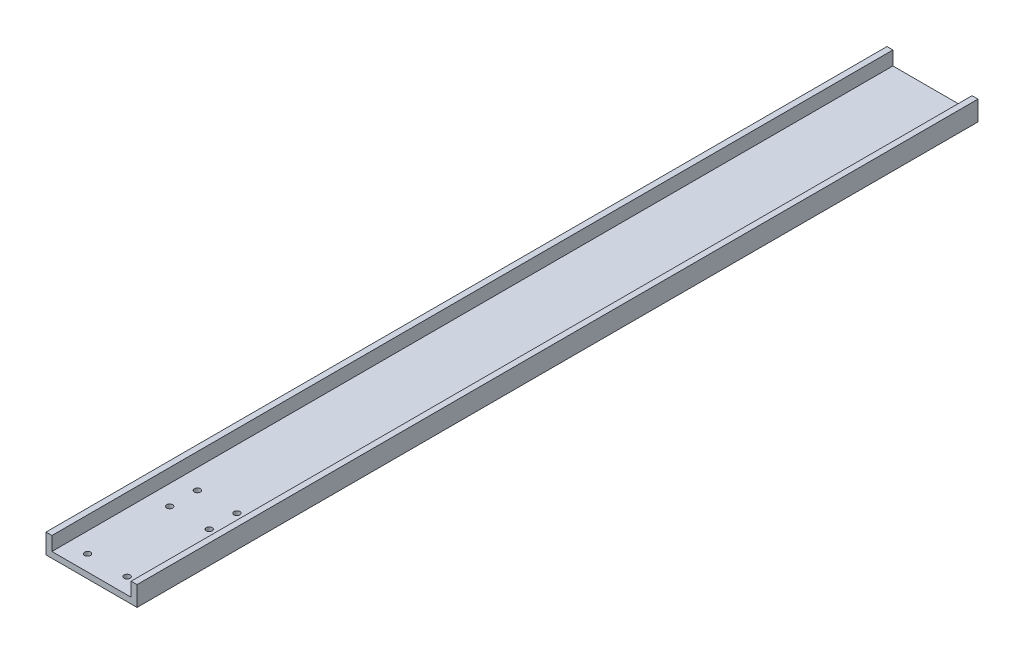
ISO-10303-21;
HEADER;
FILE_DESCRIPTION(('STEP AP214'),'2;1');
FILE_NAME('part.step','',(''),(''),'','','');
FILE_SCHEMA(('AUTOMOTIVE_DESIGN { 1 0 10303 214 1 1 1 1 }'));
ENDSEC;
DATA;
#1=APPLICATION_CONTEXT('core data for automotive mechanical design processes');
#2=APPLICATION_PROTOCOL_DEFINITION('international standard','automotive_design',2000,#1);
#3=PRODUCT_CONTEXT('',#1,'mechanical');
#4=PRODUCT('Part','Part','',(#3));
#5=PRODUCT_RELATED_PRODUCT_CATEGORY('part','',(#4));
#6=PRODUCT_DEFINITION_FORMATION('','',#4);
#7=PRODUCT_DEFINITION_CONTEXT('part definition',#1,'design');
#8=PRODUCT_DEFINITION('design','',#6,#7);
#9=PRODUCT_DEFINITION_SHAPE('','',#8);
#10=(LENGTH_UNIT() NAMED_UNIT(*) SI_UNIT(.MILLI.,.METRE.));
#11=(NAMED_UNIT(*) PLANE_ANGLE_UNIT() SI_UNIT($,.RADIAN.));
#12=(NAMED_UNIT(*) SI_UNIT($,.STERADIAN.) SOLID_ANGLE_UNIT());
#13=UNCERTAINTY_MEASURE_WITH_UNIT(LENGTH_MEASURE(1.E-05),#10,'distance_accuracy_value','');
#14=(GEOMETRIC_REPRESENTATION_CONTEXT(3) GLOBAL_UNCERTAINTY_ASSIGNED_CONTEXT((#13)) GLOBAL_UNIT_ASSIGNED_CONTEXT((#10,
#11,#12)) REPRESENTATION_CONTEXT('',''));
#15=CARTESIAN_POINT('',(0.,0.,0.));
#16=DIRECTION('',(0.,0.,1.));
#17=DIRECTION('',(1.,0.,0.));
#18=AXIS2_PLACEMENT_3D('',#15,#16,#17);
#19=CARTESIAN_POINT('',(-3.,-3.,425.));
#20=DIRECTION('',(0.,1.,0.));
#21=DIRECTION('',(-1.,0.,0.));
#22=AXIS2_PLACEMENT_3D('',#19,#20,#21);
#23=PLANE('',#22);
#24=CARTESIAN_POINT('',(30.,-3.,417.));
#25=DIRECTION('',(0.,-1.,0.));
#26=DIRECTION('',(0.,0.,-1.));
#27=AXIS2_PLACEMENT_3D('',#24,#25,#26);
#28=CIRCLE('',#27,1.49999999999999);
#29=CARTESIAN_POINT('',(30.,-3.,415.5));
#30=VERTEX_POINT('',#29);
#31=EDGE_CURVE('E252',#30,#30,#28,.T.);
#32=ORIENTED_EDGE('',*,*,#31,.F.);
#33=EDGE_LOOP('',(#32));
#34=FACE_BOUND('',#33,.T.);
#35=DIRECTION('',(1.,0.,0.));
#36=VECTOR('',#35,1.);
#37=CARTESIAN_POINT('',(-3.,-3.,0.));
#38=LINE('',#37,#36);
#39=CARTESIAN_POINT('',(-3.,-3.,0.));
#40=VERTEX_POINT('',#39);
#41=CARTESIAN_POINT('',(43.,-3.,0.));
#42=VERTEX_POINT('',#41);
#43=EDGE_CURVE('E122',#40,#42,#38,.T.);
#44=ORIENTED_EDGE('',*,*,#43,.T.);
#45=DIRECTION('',(0.,0.,-1.));
#46=VECTOR('',#45,1.);
#47=CARTESIAN_POINT('',(43.,-3.,425.));
#48=LINE('',#47,#46);
#49=CARTESIAN_POINT('',(43.,-3.,425.));
#50=VERTEX_POINT('',#49);
#51=EDGE_CURVE('E119',#50,#42,#48,.T.);
#52=ORIENTED_EDGE('',*,*,#51,.F.);
#53=DIRECTION('',(1.,0.,0.));
#54=VECTOR('',#53,1.);
#55=CARTESIAN_POINT('',(-3.,-3.,425.));
#56=LINE('',#55,#54);
#57=CARTESIAN_POINT('',(-3.,-3.,425.));
#58=VERTEX_POINT('',#57);
#59=EDGE_CURVE('E108',#58,#50,#56,.T.);
#60=ORIENTED_EDGE('',*,*,#59,.F.);
#61=DIRECTION('',(0.,0.,-1.));
#62=VECTOR('',#61,1.);
#63=CARTESIAN_POINT('',(-3.,-3.,425.));
#64=LINE('',#63,#62);
#65=EDGE_CURVE('E123',#58,#40,#64,.T.);
#66=ORIENTED_EDGE('',*,*,#65,.T.);
#67=EDGE_LOOP('',(#44,#52,#60,#66));
#68=FACE_BOUND('',#67,.T.);
#69=CARTESIAN_POINT('',(10.,-3.,361.5));
#70=DIRECTION('',(0.,1.,0.));
#71=DIRECTION('',(-1.,0.,0.));
#72=AXIS2_PLACEMENT_3D('',#69,#70,#71);
#73=CIRCLE('',#72,1.49999999999999);
#74=CARTESIAN_POINT('',(8.50000000000001,-3.,361.5));
#75=VERTEX_POINT('',#74);
#76=EDGE_CURVE('E136',#75,#75,#73,.T.);
#77=ORIENTED_EDGE('',*,*,#76,.T.);
#78=EDGE_LOOP('',(#77));
#79=FACE_BOUND('',#78,.T.);
#80=CARTESIAN_POINT('',(30.,-3.,361.5));
#81=DIRECTION('',(0.,1.,0.));
#82=DIRECTION('',(-1.,0.,0.));
#83=AXIS2_PLACEMENT_3D('',#80,#81,#82);
#84=CIRCLE('',#83,1.49999999999999);
#85=CARTESIAN_POINT('',(28.5,-3.,361.5));
#86=VERTEX_POINT('',#85);
#87=EDGE_CURVE('E158',#86,#86,#84,.T.);
#88=ORIENTED_EDGE('',*,*,#87,.T.);
#89=EDGE_LOOP('',(#88));
#90=FACE_BOUND('',#89,.T.);
#91=CARTESIAN_POINT('',(30.,-3.,375.5));
#92=DIRECTION('',(0.,1.,0.));
#93=DIRECTION('',(-1.,0.,0.));
#94=AXIS2_PLACEMENT_3D('',#91,#92,#93);
#95=CIRCLE('',#94,1.49999999999999);
#96=CARTESIAN_POINT('',(28.5,-3.,375.5));
#97=VERTEX_POINT('',#96);
#98=EDGE_CURVE('E167',#97,#97,#95,.T.);
#99=ORIENTED_EDGE('',*,*,#98,.T.);
#100=EDGE_LOOP('',(#99));
#101=FACE_BOUND('',#100,.T.);
#102=CARTESIAN_POINT('',(10.,-3.,375.5));
#103=DIRECTION('',(0.,1.,0.));
#104=DIRECTION('',(-1.,0.,0.));
#105=AXIS2_PLACEMENT_3D('',#102,#103,#104);
#106=CIRCLE('',#105,1.49999999999999);
#107=CARTESIAN_POINT('',(8.50000000000001,-3.,375.5));
#108=VERTEX_POINT('',#107);
#109=EDGE_CURVE('E37',#108,#108,#106,.T.);
#110=ORIENTED_EDGE('',*,*,#109,.T.);
#111=EDGE_LOOP('',(#110));
#112=FACE_BOUND('',#111,.T.);
#113=CARTESIAN_POINT('',(10.,-3.,417.));
#114=DIRECTION('',(0.,-1.,0.));
#115=DIRECTION('',(0.,0.,-1.));
#116=AXIS2_PLACEMENT_3D('',#113,#114,#115);
#117=CIRCLE('',#116,1.49999999999999);
#118=CARTESIAN_POINT('',(10.,-3.,415.5));
#119=VERTEX_POINT('',#118);
#120=EDGE_CURVE('E246',#119,#119,#117,.T.);
#121=ORIENTED_EDGE('',*,*,#120,.F.);
#122=EDGE_LOOP('',(#121));
#123=FACE_BOUND('',#122,.T.);
#124=ADVANCED_FACE('F33',(#34,#68,#79,#90,#101,#112,#123),#23,.F.);
#125=CARTESIAN_POINT('',(40.,0.,425.));
#126=DIRECTION('',(0.,-1.,0.));
#127=DIRECTION('',(0.,0.,-1.));
#128=AXIS2_PLACEMENT_3D('',#125,#126,#127);
#129=PLANE('',#128);
#130=CARTESIAN_POINT('',(30.,0.,417.));
#131=DIRECTION('',(0.,-1.,0.));
#132=DIRECTION('',(0.,0.,-1.));
#133=AXIS2_PLACEMENT_3D('',#130,#131,#132);
#134=CIRCLE('',#133,1.49999999999999);
#135=CARTESIAN_POINT('',(30.,0.,415.5));
#136=VERTEX_POINT('',#135);
#137=EDGE_CURVE('E249',#136,#136,#134,.T.);
#138=ORIENTED_EDGE('',*,*,#137,.T.);
#139=EDGE_LOOP('',(#138));
#140=FACE_BOUND('',#139,.T.);
#141=CARTESIAN_POINT('',(10.,0.,417.));
#142=DIRECTION('',(0.,-1.,0.));
#143=DIRECTION('',(0.,0.,-1.));
#144=AXIS2_PLACEMENT_3D('',#141,#142,#143);
#145=CIRCLE('',#144,1.49999999999999);
#146=CARTESIAN_POINT('',(10.,0.,415.5));
#147=VERTEX_POINT('',#146);
#148=EDGE_CURVE('E243',#147,#147,#145,.T.);
#149=ORIENTED_EDGE('',*,*,#148,.T.);
#150=EDGE_LOOP('',(#149));
#151=FACE_BOUND('',#150,.T.);
#152=CARTESIAN_POINT('',(10.,0.,375.5));
#153=DIRECTION('',(0.,1.,0.));
#154=DIRECTION('',(0.,0.,1.));
#155=AXIS2_PLACEMENT_3D('',#152,#153,#154);
#156=CIRCLE('',#155,1.49999999999999);
#157=CARTESIAN_POINT('',(10.,0.,377.));
#158=VERTEX_POINT('',#157);
#159=EDGE_CURVE('E239',#158,#158,#156,.T.);
#160=ORIENTED_EDGE('',*,*,#159,.F.);
#161=EDGE_LOOP('',(#160));
#162=FACE_BOUND('',#161,.T.);
#163=DIRECTION('',(-1.,0.,0.));
#164=VECTOR('',#163,1.);
#165=CARTESIAN_POINT('',(40.,0.,0.));
#166=LINE('',#165,#164);
#167=CARTESIAN_POINT('',(40.,0.,0.));
#168=VERTEX_POINT('',#167);
#169=CARTESIAN_POINT('',(0.,0.,0.));
#170=VERTEX_POINT('',#169);
#171=EDGE_CURVE('E135',#168,#170,#166,.T.);
#172=ORIENTED_EDGE('',*,*,#171,.T.);
#173=DIRECTION('',(0.,0.,-1.));
#174=VECTOR('',#173,1.);
#175=CARTESIAN_POINT('',(0.,0.,425.));
#176=LINE('',#175,#174);
#177=CARTESIAN_POINT('',(0.,0.,425.));
#178=VERTEX_POINT('',#177);
#179=EDGE_CURVE('E43',#178,#170,#176,.T.);
#180=ORIENTED_EDGE('',*,*,#179,.F.);
#181=DIRECTION('',(-1.,0.,0.));
#182=VECTOR('',#181,1.);
#183=CARTESIAN_POINT('',(40.,0.,425.));
#184=LINE('',#183,#182);
#185=CARTESIAN_POINT('',(40.,0.,425.));
#186=VERTEX_POINT('',#185);
#187=EDGE_CURVE('E95',#186,#178,#184,.T.);
#188=ORIENTED_EDGE('',*,*,#187,.F.);
#189=DIRECTION('',(0.,0.,-1.));
#190=VECTOR('',#189,1.);
#191=CARTESIAN_POINT('',(40.,0.,425.));
#192=LINE('',#191,#190);
#193=EDGE_CURVE('E11',#186,#168,#192,.T.);
#194=ORIENTED_EDGE('',*,*,#193,.T.);
#195=EDGE_LOOP('',(#172,#180,#188,#194));
#196=FACE_BOUND('',#195,.T.);
#197=CARTESIAN_POINT('',(10.,0.,361.5));
#198=DIRECTION('',(0.,1.,0.));
#199=DIRECTION('',(0.,0.,1.));
#200=AXIS2_PLACEMENT_3D('',#197,#198,#199);
#201=CIRCLE('',#200,1.49999999999999);
#202=CARTESIAN_POINT('',(10.,0.,363.));
#203=VERTEX_POINT('',#202);
#204=EDGE_CURVE('E160',#203,#203,#201,.T.);
#205=ORIENTED_EDGE('',*,*,#204,.F.);
#206=EDGE_LOOP('',(#205));
#207=FACE_BOUND('',#206,.T.);
#208=CARTESIAN_POINT('',(30.,0.,361.5));
#209=DIRECTION('',(0.,1.,0.));
#210=DIRECTION('',(0.,0.,1.));
#211=AXIS2_PLACEMENT_3D('',#208,#209,#210);
#212=CIRCLE('',#211,1.49999999999999);
#213=CARTESIAN_POINT('',(30.,0.,363.));
#214=VERTEX_POINT('',#213);
#215=EDGE_CURVE('E161',#214,#214,#212,.T.);
#216=ORIENTED_EDGE('',*,*,#215,.F.);
#217=EDGE_LOOP('',(#216));
#218=FACE_BOUND('',#217,.T.);
#219=CARTESIAN_POINT('',(30.,0.,375.5));
#220=DIRECTION('',(0.,1.,0.));
#221=DIRECTION('',(0.,0.,1.));
#222=AXIS2_PLACEMENT_3D('',#219,#220,#221);
#223=CIRCLE('',#222,1.49999999999999);
#224=CARTESIAN_POINT('',(30.,0.,377.));
#225=VERTEX_POINT('',#224);
#226=EDGE_CURVE('E172',#225,#225,#223,.T.);
#227=ORIENTED_EDGE('',*,*,#226,.F.);
#228=EDGE_LOOP('',(#227));
#229=FACE_BOUND('',#228,.T.);
#230=ADVANCED_FACE('F211',(#140,#151,#162,#196,#207,#218,#229),#129,.F.);
#231=CARTESIAN_POINT('',(40.,6.99999999999999,425.));
#232=DIRECTION('',(1.,0.,0.));
#233=DIRECTION('',(0.,0.,-1.));
#234=AXIS2_PLACEMENT_3D('',#231,#232,#233);
#235=PLANE('',#234);
#236=DIRECTION('',(0.,-1.,0.));
#237=VECTOR('',#236,1.);
#238=CARTESIAN_POINT('',(40.,6.99999999999999,0.));
#239=LINE('',#238,#237);
#240=CARTESIAN_POINT('',(40.,6.99999999999999,0.));
#241=VERTEX_POINT('',#240);
#242=EDGE_CURVE('E132',#241,#168,#239,.T.);
#243=ORIENTED_EDGE('',*,*,#242,.T.);
#244=ORIENTED_EDGE('',*,*,#193,.F.);
#245=DIRECTION('',(0.,-1.,0.));
#246=VECTOR('',#245,1.);
#247=CARTESIAN_POINT('',(40.,6.99999999999999,425.));
#248=LINE('',#247,#246);
#249=CARTESIAN_POINT('',(40.,6.99999999999999,425.));
#250=VERTEX_POINT('',#249);
#251=EDGE_CURVE('E147',#250,#186,#248,.T.);
#252=ORIENTED_EDGE('',*,*,#251,.F.);
#253=DIRECTION('',(0.,0.,-1.));
#254=VECTOR('',#253,1.);
#255=CARTESIAN_POINT('',(40.,6.99999999999999,425.));
#256=LINE('',#255,#254);
#257=EDGE_CURVE('E128',#250,#241,#256,.T.);
#258=ORIENTED_EDGE('',*,*,#257,.T.);
#259=EDGE_LOOP('',(#243,#244,#252,#258));
#260=FACE_BOUND('',#259,.T.);
#261=ADVANCED_FACE('F35',(#260),#235,.F.);
#262=CARTESIAN_POINT('',(0.,0.,425.));
#263=DIRECTION('',(-1.,0.,0.));
#264=DIRECTION('',(0.,0.,1.));
#265=AXIS2_PLACEMENT_3D('',#262,#263,#264);
#266=PLANE('',#265);
#267=DIRECTION('',(0.,1.,0.));
#268=VECTOR('',#267,1.);
#269=CARTESIAN_POINT('',(0.,0.,0.));
#270=LINE('',#269,#268);
#271=CARTESIAN_POINT('',(0.,6.99999999999999,0.));
#272=VERTEX_POINT('',#271);
#273=EDGE_CURVE('E138',#170,#272,#270,.T.);
#274=ORIENTED_EDGE('',*,*,#273,.T.);
#275=DIRECTION('',(0.,0.,-1.));
#276=VECTOR('',#275,1.);
#277=CARTESIAN_POINT('',(0.,6.99999999999999,425.));
#278=LINE('',#277,#276);
#279=CARTESIAN_POINT('',(0.,6.99999999999999,425.));
#280=VERTEX_POINT('',#279);
#281=EDGE_CURVE('E154',#280,#272,#278,.T.);
#282=ORIENTED_EDGE('',*,*,#281,.F.);
#283=DIRECTION('',(0.,1.,0.));
#284=VECTOR('',#283,1.);
#285=CARTESIAN_POINT('',(0.,0.,425.));
#286=LINE('',#285,#284);
#287=EDGE_CURVE('E180',#178,#280,#286,.T.);
#288=ORIENTED_EDGE('',*,*,#287,.F.);
#289=ORIENTED_EDGE('',*,*,#179,.T.);
#290=EDGE_LOOP('',(#274,#282,#288,#289));
#291=FACE_BOUND('',#290,.T.);
#292=ADVANCED_FACE('F225',(#291),#266,.F.);
#293=CARTESIAN_POINT('',(0.,6.99999999999999,425.));
#294=DIRECTION('',(0.,-1.,0.));
#295=DIRECTION('',(0.,0.,-1.));
#296=AXIS2_PLACEMENT_3D('',#293,#294,#295);
#297=PLANE('',#296);
#298=DIRECTION('',(-1.,0.,0.));
#299=VECTOR('',#298,1.);
#300=CARTESIAN_POINT('',(0.,6.99999999999999,0.));
#301=LINE('',#300,#299);
#302=CARTESIAN_POINT('',(-3.,6.99999999999999,0.));
#303=VERTEX_POINT('',#302);
#304=EDGE_CURVE('E140',#272,#303,#301,.T.);
#305=ORIENTED_EDGE('',*,*,#304,.T.);
#306=DIRECTION('',(0.,0.,-1.));
#307=VECTOR('',#306,1.);
#308=CARTESIAN_POINT('',(-3.,6.99999999999999,425.));
#309=LINE('',#308,#307);
#310=CARTESIAN_POINT('',(-3.,6.99999999999999,425.));
#311=VERTEX_POINT('',#310);
#312=EDGE_CURVE('E151',#311,#303,#309,.T.);
#313=ORIENTED_EDGE('',*,*,#312,.F.);
#314=DIRECTION('',(-1.,0.,0.));
#315=VECTOR('',#314,1.);
#316=CARTESIAN_POINT('',(0.,6.99999999999999,425.));
#317=LINE('',#316,#315);
#318=EDGE_CURVE('E182',#280,#311,#317,.T.);
#319=ORIENTED_EDGE('',*,*,#318,.F.);
#320=ORIENTED_EDGE('',*,*,#281,.T.);
#321=EDGE_LOOP('',(#305,#313,#319,#320));
#322=FACE_BOUND('',#321,.T.);
#323=ADVANCED_FACE('F188',(#322),#297,.F.);
#324=CARTESIAN_POINT('',(-3.,6.99999999999999,425.));
#325=DIRECTION('',(1.,0.,0.));
#326=DIRECTION('',(0.,1.,0.));
#327=AXIS2_PLACEMENT_3D('',#324,#325,#326);
#328=PLANE('',#327);
#329=DIRECTION('',(0.,-1.,0.));
#330=VECTOR('',#329,1.);
#331=CARTESIAN_POINT('',(-3.,6.99999999999999,0.));
#332=LINE('',#331,#330);
#333=EDGE_CURVE('E142',#303,#40,#332,.T.);
#334=ORIENTED_EDGE('',*,*,#333,.T.);
#335=ORIENTED_EDGE('',*,*,#65,.F.);
#336=DIRECTION('',(0.,-1.,0.));
#337=VECTOR('',#336,1.);
#338=CARTESIAN_POINT('',(-3.,6.99999999999999,425.));
#339=LINE('',#338,#337);
#340=EDGE_CURVE('E114',#311,#58,#339,.T.);
#341=ORIENTED_EDGE('',*,*,#340,.F.);
#342=ORIENTED_EDGE('',*,*,#312,.T.);
#343=EDGE_LOOP('',(#334,#335,#341,#342));
#344=FACE_BOUND('',#343,.T.);
#345=ADVANCED_FACE('F192',(#344),#328,.F.);
#346=CARTESIAN_POINT('',(43.,-3.,425.));
#347=DIRECTION('',(-1.,0.,0.));
#348=DIRECTION('',(0.,0.,1.));
#349=AXIS2_PLACEMENT_3D('',#346,#347,#348);
#350=PLANE('',#349);
#351=DIRECTION('',(0.,1.,0.));
#352=VECTOR('',#351,1.);
#353=CARTESIAN_POINT('',(43.,-3.,0.));
#354=LINE('',#353,#352);
#355=CARTESIAN_POINT('',(43.,6.99999999999999,0.));
#356=VERTEX_POINT('',#355);
#357=EDGE_CURVE('E81',#42,#356,#354,.T.);
#358=ORIENTED_EDGE('',*,*,#357,.T.);
#359=DIRECTION('',(0.,0.,-1.));
#360=VECTOR('',#359,1.);
#361=CARTESIAN_POINT('',(43.,6.99999999999999,425.));
#362=LINE('',#361,#360);
#363=CARTESIAN_POINT('',(43.,6.99999999999999,425.));
#364=VERTEX_POINT('',#363);
#365=EDGE_CURVE('E124',#364,#356,#362,.T.);
#366=ORIENTED_EDGE('',*,*,#365,.F.);
#367=DIRECTION('',(0.,1.,0.));
#368=VECTOR('',#367,1.);
#369=CARTESIAN_POINT('',(43.,-3.,425.));
#370=LINE('',#369,#368);
#371=EDGE_CURVE('E112',#50,#364,#370,.T.);
#372=ORIENTED_EDGE('',*,*,#371,.F.);
#373=ORIENTED_EDGE('',*,*,#51,.T.);
#374=EDGE_LOOP('',(#358,#366,#372,#373));
#375=FACE_BOUND('',#374,.T.);
#376=ADVANCED_FACE('F126',(#375),#350,.F.);
#377=CARTESIAN_POINT('',(43.,6.99999999999999,425.));
#378=DIRECTION('',(0.,-1.,0.));
#379=DIRECTION('',(0.,0.,-1.));
#380=AXIS2_PLACEMENT_3D('',#377,#378,#379);
#381=PLANE('',#380);
#382=DIRECTION('',(-1.,0.,0.));
#383=VECTOR('',#382,1.);
#384=CARTESIAN_POINT('',(43.,6.99999999999999,0.));
#385=LINE('',#384,#383);
#386=EDGE_CURVE('E87',#356,#241,#385,.T.);
#387=ORIENTED_EDGE('',*,*,#386,.T.);
#388=ORIENTED_EDGE('',*,*,#257,.F.);
#389=DIRECTION('',(-1.,0.,0.));
#390=VECTOR('',#389,1.);
#391=CARTESIAN_POINT('',(43.,6.99999999999999,425.));
#392=LINE('',#391,#390);
#393=EDGE_CURVE('E52',#364,#250,#392,.T.);
#394=ORIENTED_EDGE('',*,*,#393,.F.);
#395=ORIENTED_EDGE('',*,*,#365,.T.);
#396=EDGE_LOOP('',(#387,#388,#394,#395));
#397=FACE_BOUND('',#396,.T.);
#398=ADVANCED_FACE('F200',(#397),#381,.F.);
#399=CARTESIAN_POINT('',(0.,0.,425.));
#400=DIRECTION('',(0.,0.,-1.));
#401=DIRECTION('',(-1.,0.,0.));
#402=AXIS2_PLACEMENT_3D('',#399,#400,#401);
#403=PLANE('',#402);
#404=ORIENTED_EDGE('',*,*,#251,.T.);
#405=ORIENTED_EDGE('',*,*,#187,.T.);
#406=ORIENTED_EDGE('',*,*,#287,.T.);
#407=ORIENTED_EDGE('',*,*,#318,.T.);
#408=ORIENTED_EDGE('',*,*,#340,.T.);
#409=ORIENTED_EDGE('',*,*,#59,.T.);
#410=ORIENTED_EDGE('',*,*,#371,.T.);
#411=ORIENTED_EDGE('',*,*,#393,.T.);
#412=EDGE_LOOP('',(#404,#405,#406,#407,#408,#409,#410,#411));
#413=FACE_BOUND('',#412,.T.);
#414=ADVANCED_FACE('F110',(#413),#403,.F.);
#415=CARTESIAN_POINT('',(0.,0.,0.));
#416=DIRECTION('',(0.,0.,-1.));
#417=DIRECTION('',(-1.,0.,0.));
#418=AXIS2_PLACEMENT_3D('',#415,#416,#417);
#419=PLANE('',#418);
#420=ORIENTED_EDGE('',*,*,#242,.F.);
#421=ORIENTED_EDGE('',*,*,#386,.F.);
#422=ORIENTED_EDGE('',*,*,#357,.F.);
#423=ORIENTED_EDGE('',*,*,#43,.F.);
#424=ORIENTED_EDGE('',*,*,#333,.F.);
#425=ORIENTED_EDGE('',*,*,#304,.F.);
#426=ORIENTED_EDGE('',*,*,#273,.F.);
#427=ORIENTED_EDGE('',*,*,#171,.F.);
#428=EDGE_LOOP('',(#420,#421,#422,#423,#424,#425,#426,#427));
#429=FACE_BOUND('',#428,.T.);
#430=ADVANCED_FACE('F195',(#429),#419,.T.);
#431=CARTESIAN_POINT('',(10.,0.,361.5));
#432=DIRECTION('',(0.,1.,0.));
#433=DIRECTION('',(0.,0.,1.));
#434=AXIS2_PLACEMENT_3D('',#431,#432,#433);
#435=CYLINDRICAL_SURFACE('',#434,1.49999999999999);
#436=ORIENTED_EDGE('',*,*,#204,.T.);
#437=EDGE_LOOP('',(#436));
#438=FACE_BOUND('',#437,.T.);
#439=ORIENTED_EDGE('',*,*,#76,.F.);
#440=EDGE_LOOP('',(#439));
#441=FACE_BOUND('',#440,.T.);
#442=ADVANCED_FACE('F288',(#438,#441),#435,.F.);
#443=CARTESIAN_POINT('',(30.,0.,361.5));
#444=DIRECTION('',(0.,1.,0.));
#445=DIRECTION('',(0.,0.,1.));
#446=AXIS2_PLACEMENT_3D('',#443,#444,#445);
#447=CYLINDRICAL_SURFACE('',#446,1.49999999999999);
#448=ORIENTED_EDGE('',*,*,#215,.T.);
#449=EDGE_LOOP('',(#448));
#450=FACE_BOUND('',#449,.T.);
#451=ORIENTED_EDGE('',*,*,#87,.F.);
#452=EDGE_LOOP('',(#451));
#453=FACE_BOUND('',#452,.T.);
#454=ADVANCED_FACE('F285',(#450,#453),#447,.F.);
#455=CARTESIAN_POINT('',(30.,0.,375.5));
#456=DIRECTION('',(0.,1.,0.));
#457=DIRECTION('',(0.,0.,1.));
#458=AXIS2_PLACEMENT_3D('',#455,#456,#457);
#459=CYLINDRICAL_SURFACE('',#458,1.49999999999999);
#460=ORIENTED_EDGE('',*,*,#226,.T.);
#461=EDGE_LOOP('',(#460));
#462=FACE_BOUND('',#461,.T.);
#463=ORIENTED_EDGE('',*,*,#98,.F.);
#464=EDGE_LOOP('',(#463));
#465=FACE_BOUND('',#464,.T.);
#466=ADVANCED_FACE('F269',(#462,#465),#459,.F.);
#467=CARTESIAN_POINT('',(10.,0.,375.5));
#468=DIRECTION('',(0.,1.,0.));
#469=DIRECTION('',(0.,0.,1.));
#470=AXIS2_PLACEMENT_3D('',#467,#468,#469);
#471=CYLINDRICAL_SURFACE('',#470,1.49999999999999);
#472=ORIENTED_EDGE('',*,*,#159,.T.);
#473=EDGE_LOOP('',(#472));
#474=FACE_BOUND('',#473,.T.);
#475=ORIENTED_EDGE('',*,*,#109,.F.);
#476=EDGE_LOOP('',(#475));
#477=FACE_BOUND('',#476,.T.);
#478=ADVANCED_FACE('F266',(#474,#477),#471,.F.);
#479=CARTESIAN_POINT('',(10.,-3.,417.));
#480=DIRECTION('',(0.,-1.,0.));
#481=DIRECTION('',(0.,0.,-1.));
#482=AXIS2_PLACEMENT_3D('',#479,#480,#481);
#483=CYLINDRICAL_SURFACE('',#482,1.49999999999999);
#484=ORIENTED_EDGE('',*,*,#120,.T.);
#485=EDGE_LOOP('',(#484));
#486=FACE_BOUND('',#485,.T.);
#487=ORIENTED_EDGE('',*,*,#148,.F.);
#488=EDGE_LOOP('',(#487));
#489=FACE_BOUND('',#488,.T.);
#490=ADVANCED_FACE('F258',(#486,#489),#483,.F.);
#491=CARTESIAN_POINT('',(30.,-3.,417.));
#492=DIRECTION('',(0.,-1.,0.));
#493=DIRECTION('',(0.,0.,-1.));
#494=AXIS2_PLACEMENT_3D('',#491,#492,#493);
#495=CYLINDRICAL_SURFACE('',#494,1.49999999999999);
#496=ORIENTED_EDGE('',*,*,#31,.T.);
#497=EDGE_LOOP('',(#496));
#498=FACE_BOUND('',#497,.T.);
#499=ORIENTED_EDGE('',*,*,#137,.F.);
#500=EDGE_LOOP('',(#499));
#501=FACE_BOUND('',#500,.T.);
#502=ADVANCED_FACE('F255',(#498,#501),#495,.F.);
#503=CLOSED_SHELL('',(#124,#230,#261,#292,#323,#345,#376,#398,#414,#430,#442,#454,#466,#478,
#490,#502));
#504=MANIFOLD_SOLID_BREP('B2',#503);
#505=ADVANCED_BREP_SHAPE_REPRESENTATION('',(#18,#504),#14);
#506=SHAPE_DEFINITION_REPRESENTATION(#9,#505);
ENDSEC;
END-ISO-10303-21;
